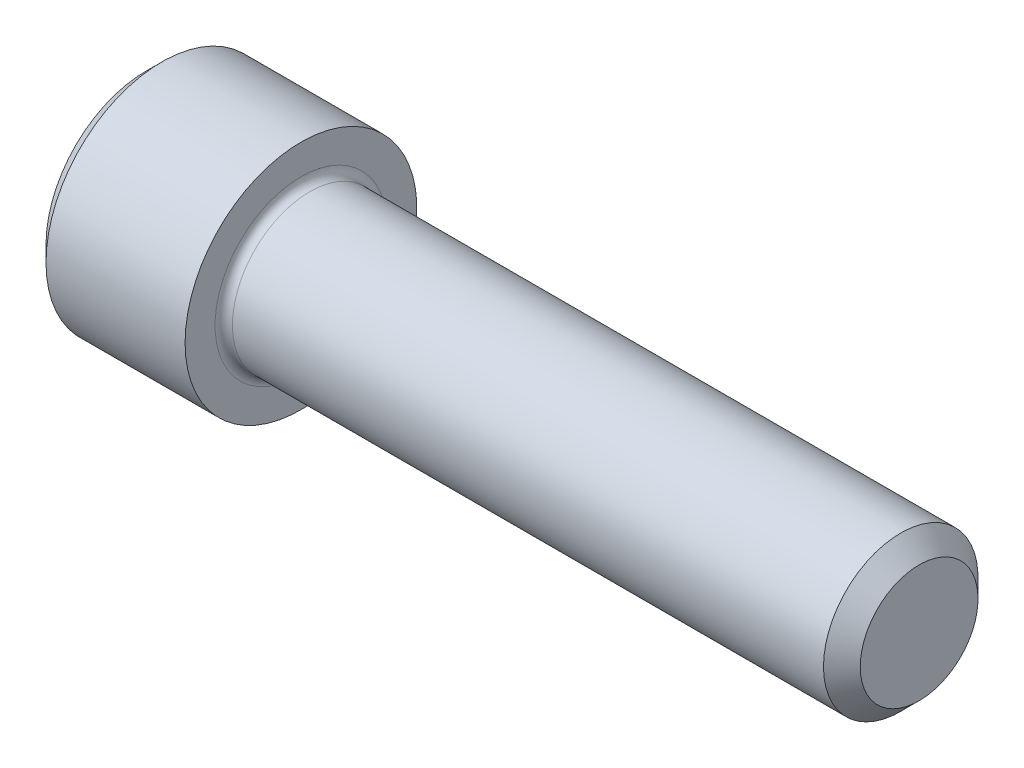
ISO-10303-21;
HEADER;
FILE_DESCRIPTION(('STEP AP214'),'2;1');
FILE_NAME('part.step','',(''),(''),'','','');
FILE_SCHEMA(('AUTOMOTIVE_DESIGN { 1 0 10303 214 1 1 1 1 }'));
ENDSEC;
DATA;
#1=APPLICATION_CONTEXT('core data for automotive mechanical design processes');
#2=APPLICATION_PROTOCOL_DEFINITION('international standard','automotive_design',2000,#1);
#3=PRODUCT_CONTEXT('',#1,'mechanical');
#4=PRODUCT('Part','Part','',(#3));
#5=PRODUCT_RELATED_PRODUCT_CATEGORY('part','',(#4));
#6=PRODUCT_DEFINITION_FORMATION('','',#4);
#7=PRODUCT_DEFINITION_CONTEXT('part definition',#1,'design');
#8=PRODUCT_DEFINITION('design','',#6,#7);
#9=PRODUCT_DEFINITION_SHAPE('','',#8);
#10=(LENGTH_UNIT() NAMED_UNIT(*) SI_UNIT(.MILLI.,.METRE.));
#11=(NAMED_UNIT(*) PLANE_ANGLE_UNIT() SI_UNIT($,.RADIAN.));
#12=(NAMED_UNIT(*) SI_UNIT($,.STERADIAN.) SOLID_ANGLE_UNIT());
#13=UNCERTAINTY_MEASURE_WITH_UNIT(LENGTH_MEASURE(1.E-05),#10,'distance_accuracy_value','');
#14=(GEOMETRIC_REPRESENTATION_CONTEXT(3) GLOBAL_UNCERTAINTY_ASSIGNED_CONTEXT((#13)) GLOBAL_UNIT_ASSIGNED_CONTEXT((#10,
#11,#12)) REPRESENTATION_CONTEXT('',''));
#15=CARTESIAN_POINT('',(0.,0.,0.));
#16=DIRECTION('',(0.,0.,1.));
#17=DIRECTION('',(1.,0.,0.));
#18=AXIS2_PLACEMENT_3D('',#15,#16,#17);
#19=CARTESIAN_POINT('',(0.,0.,0.));
#20=DIRECTION('',(-1.,0.,0.));
#21=DIRECTION('',(0.,0.,1.));
#22=AXIS2_PLACEMENT_3D('',#19,#20,#21);
#23=PLANE('',#22);
#24=DIRECTION('',(0.,-0.499999999999999,0.86602540378444));
#25=VECTOR('',#24,1.);
#26=CARTESIAN_POINT('',(0.,2.7496306570156,0.));
#27=LINE('',#26,#25);
#28=CARTESIAN_POINT('',(0.,2.7496306570156,0.));
#29=VERTEX_POINT('',#28);
#30=CARTESIAN_POINT('',(0.,1.37481532850781,2.38125));
#31=VERTEX_POINT('',#30);
#32=EDGE_CURVE('E257',#29,#31,#27,.T.);
#33=ORIENTED_EDGE('',*,*,#32,.T.);
#34=DIRECTION('',(0.,1.,0.));
#35=VECTOR('',#34,1.);
#36=CARTESIAN_POINT('',(0.,-1.37481532850779,2.38125));
#37=LINE('',#36,#35);
#38=CARTESIAN_POINT('',(0.,-1.37481532850779,2.38125));
#39=VERTEX_POINT('',#38);
#40=EDGE_CURVE('E128',#39,#31,#37,.T.);
#41=ORIENTED_EDGE('',*,*,#40,.F.);
#42=DIRECTION('',(0.,-0.500000000000001,-0.866025403784438));
#43=VECTOR('',#42,1.);
#44=CARTESIAN_POINT('',(0.,-1.37481532850779,2.38125));
#45=LINE('',#44,#43);
#46=CARTESIAN_POINT('',(0.,-2.74963065701559,0.));
#47=VERTEX_POINT('',#46);
#48=EDGE_CURVE('E260',#39,#47,#45,.T.);
#49=ORIENTED_EDGE('',*,*,#48,.T.);
#50=DIRECTION('',(0.,0.499999999999998,-0.86602540378444));
#51=VECTOR('',#50,1.);
#52=CARTESIAN_POINT('',(0.,-2.74963065701559,0.));
#53=LINE('',#52,#51);
#54=CARTESIAN_POINT('',(0.,-1.37481532850779,-2.38125));
#55=VERTEX_POINT('',#54);
#56=EDGE_CURVE('E263',#47,#55,#53,.T.);
#57=ORIENTED_EDGE('',*,*,#56,.T.);
#58=DIRECTION('',(0.,-1.,0.));
#59=VECTOR('',#58,1.);
#60=CARTESIAN_POINT('',(0.,1.3748153285078,-2.38125));
#61=LINE('',#60,#59);
#62=CARTESIAN_POINT('',(0.,1.3748153285078,-2.38125));
#63=VERTEX_POINT('',#62);
#64=EDGE_CURVE('E266',#63,#55,#61,.T.);
#65=ORIENTED_EDGE('',*,*,#64,.F.);
#66=DIRECTION('',(0.,-0.500000000000001,-0.866025403784438));
#67=VECTOR('',#66,1.);
#68=CARTESIAN_POINT('',(0.,2.7496306570156,0.));
#69=LINE('',#68,#67);
#70=EDGE_CURVE('E123',#29,#63,#69,.T.);
#71=ORIENTED_EDGE('',*,*,#70,.F.);
#72=EDGE_LOOP('',(#33,#41,#49,#57,#65,#71));
#73=FACE_BOUND('',#72,.T.);
#74=CARTESIAN_POINT('',(0.,0.,0.));
#75=DIRECTION('',(-1.,0.,0.));
#76=DIRECTION('',(0.,0.,1.));
#77=AXIS2_PLACEMENT_3D('',#74,#75,#76);
#78=CIRCLE('',#77,4.12749999999999);
#79=CARTESIAN_POINT('',(0.,0.,4.12749999999999));
#80=VERTEX_POINT('',#79);
#81=EDGE_CURVE('E152',#80,#80,#78,.T.);
#82=ORIENTED_EDGE('',*,*,#81,.T.);
#83=EDGE_LOOP('',(#82));
#84=FACE_BOUND('',#83,.T.);
#85=ADVANCED_FACE('F32',(#73,#84),#23,.T.);
#86=CARTESIAN_POINT('',(0.,0.,0.));
#87=DIRECTION('',(1.,0.,0.));
#88=DIRECTION('',(0.,0.,-1.));
#89=AXIS2_PLACEMENT_3D('',#86,#87,#88);
#90=CONICAL_SURFACE('',#89,4.12749999999999,0.785398163397457);
#91=CARTESIAN_POINT('',(0.634999999999997,0.,0.));
#92=DIRECTION('',(-1.,0.,0.));
#93=DIRECTION('',(0.,0.,1.));
#94=AXIS2_PLACEMENT_3D('',#91,#92,#93);
#95=CIRCLE('',#94,4.7625);
#96=CARTESIAN_POINT('',(0.634999999999997,0.,4.7625));
#97=VERTEX_POINT('',#96);
#98=EDGE_CURVE('E149',#97,#97,#95,.T.);
#99=ORIENTED_EDGE('',*,*,#98,.T.);
#100=EDGE_LOOP('',(#99));
#101=FACE_BOUND('',#100,.T.);
#102=ORIENTED_EDGE('',*,*,#81,.F.);
#103=EDGE_LOOP('',(#102));
#104=FACE_BOUND('',#103,.T.);
#105=ADVANCED_FACE('F173',(#101,#104),#90,.T.);
#106=CARTESIAN_POINT('',(-31.75,0.,0.));
#107=DIRECTION('',(-1.,0.,0.));
#108=DIRECTION('',(0.,0.,1.));
#109=AXIS2_PLACEMENT_3D('',#106,#107,#108);
#110=CYLINDRICAL_SURFACE('',#109,4.7625);
#111=CARTESIAN_POINT('',(6.35,0.,0.));
#112=DIRECTION('',(-1.,0.,0.));
#113=DIRECTION('',(0.,0.,1.));
#114=AXIS2_PLACEMENT_3D('',#111,#112,#113);
#115=CIRCLE('',#114,4.7625);
#116=CARTESIAN_POINT('',(6.35,0.,4.7625));
#117=VERTEX_POINT('',#116);
#118=EDGE_CURVE('E146',#117,#117,#115,.T.);
#119=ORIENTED_EDGE('',*,*,#118,.T.);
#120=EDGE_LOOP('',(#119));
#121=FACE_BOUND('',#120,.T.);
#122=ORIENTED_EDGE('',*,*,#98,.F.);
#123=EDGE_LOOP('',(#122));
#124=FACE_BOUND('',#123,.T.);
#125=ADVANCED_FACE('F178',(#121,#124),#110,.T.);
#126=CARTESIAN_POINT('',(6.35,4.7625,0.));
#127=DIRECTION('',(1.,0.,0.));
#128=DIRECTION('',(0.,0.,-1.));
#129=AXIS2_PLACEMENT_3D('',#126,#127,#128);
#130=PLANE('',#129);
#131=CARTESIAN_POINT('',(6.35,0.,0.));
#132=DIRECTION('',(1.,0.,0.));
#133=DIRECTION('',(0.,0.,-1.));
#134=AXIS2_PLACEMENT_3D('',#131,#132,#133);
#135=CIRCLE('',#134,3.5306);
#136=CARTESIAN_POINT('',(6.35,0.,-3.5306));
#137=VERTEX_POINT('',#136);
#138=EDGE_CURVE('E40',#137,#137,#135,.F.);
#139=ORIENTED_EDGE('',*,*,#138,.T.);
#140=EDGE_LOOP('',(#139));
#141=FACE_BOUND('',#140,.T.);
#142=ORIENTED_EDGE('',*,*,#118,.F.);
#143=EDGE_LOOP('',(#142));
#144=FACE_BOUND('',#143,.T.);
#145=ADVANCED_FACE('F157',(#141,#144),#130,.T.);
#146=CARTESIAN_POINT('',(-31.75,0.,0.));
#147=DIRECTION('',(-1.,0.,0.));
#148=DIRECTION('',(0.,0.,1.));
#149=AXIS2_PLACEMENT_3D('',#146,#147,#148);
#150=CYLINDRICAL_SURFACE('',#149,3.175);
#151=CARTESIAN_POINT('',(6.7056,0.,0.));
#152=DIRECTION('',(1.,0.,0.));
#153=DIRECTION('',(0.,0.,-1.));
#154=AXIS2_PLACEMENT_3D('',#151,#152,#153);
#155=CIRCLE('',#154,3.175);
#156=CARTESIAN_POINT('',(6.7056,0.,-3.175));
#157=VERTEX_POINT('',#156);
#158=EDGE_CURVE('E11',#157,#157,#155,.T.);
#159=ORIENTED_EDGE('',*,*,#158,.T.);
#160=EDGE_LOOP('',(#159));
#161=FACE_BOUND('',#160,.T.);
#162=CARTESIAN_POINT('',(30.99435,0.,0.));
#163=DIRECTION('',(-1.,0.,0.));
#164=DIRECTION('',(0.,0.,1.));
#165=AXIS2_PLACEMENT_3D('',#162,#163,#164);
#166=CIRCLE('',#165,3.175);
#167=CARTESIAN_POINT('',(30.99435,0.,3.175));
#168=VERTEX_POINT('',#167);
#169=EDGE_CURVE('E143',#168,#168,#166,.T.);
#170=ORIENTED_EDGE('',*,*,#169,.T.);
#171=EDGE_LOOP('',(#170));
#172=FACE_BOUND('',#171,.T.);
#173=ADVANCED_FACE('F188',(#161,#172),#150,.T.);
#174=CARTESIAN_POINT('',(31.75,0.,0.));
#175=DIRECTION('',(-1.,0.,0.));
#176=DIRECTION('',(0.,0.,1.));
#177=AXIS2_PLACEMENT_3D('',#174,#175,#176);
#178=CONICAL_SURFACE('',#177,2.41935,0.78539816339745);
#179=ORIENTED_EDGE('',*,*,#169,.F.);
#180=EDGE_LOOP('',(#179));
#181=FACE_BOUND('',#180,.T.);
#182=CARTESIAN_POINT('',(31.75,0.,0.));
#183=DIRECTION('',(-1.,0.,0.));
#184=DIRECTION('',(0.,0.,1.));
#185=AXIS2_PLACEMENT_3D('',#182,#183,#184);
#186=CIRCLE('',#185,2.41935);
#187=CARTESIAN_POINT('',(31.75,0.,2.41935));
#188=VERTEX_POINT('',#187);
#189=EDGE_CURVE('E139',#188,#188,#186,.T.);
#190=ORIENTED_EDGE('',*,*,#189,.T.);
#191=EDGE_LOOP('',(#190));
#192=FACE_BOUND('',#191,.T.);
#193=ADVANCED_FACE('F168',(#181,#192),#178,.T.);
#194=CARTESIAN_POINT('',(31.75,2.41935,0.));
#195=DIRECTION('',(1.,0.,0.));
#196=DIRECTION('',(0.,0.,-1.));
#197=AXIS2_PLACEMENT_3D('',#194,#195,#196);
#198=PLANE('',#197);
#199=ORIENTED_EDGE('',*,*,#189,.F.);
#200=EDGE_LOOP('',(#199));
#201=FACE_BOUND('',#200,.T.);
#202=ADVANCED_FACE('F161',(#201),#198,.T.);
#203=CARTESIAN_POINT('',(6.7056,0.,0.));
#204=DIRECTION('',(1.,0.,0.));
#205=DIRECTION('',(0.,0.,-1.));
#206=AXIS2_PLACEMENT_3D('',#203,#204,#205);
#207=TOROIDAL_SURFACE('',#206,3.5306,0.3556);
#208=ORIENTED_EDGE('',*,*,#158,.F.);
#209=EDGE_LOOP('',(#208));
#210=FACE_BOUND('',#209,.T.);
#211=ORIENTED_EDGE('',*,*,#138,.F.);
#212=EDGE_LOOP('',(#211));
#213=FACE_BOUND('',#212,.T.);
#214=ADVANCED_FACE('F34',(#210,#213),#207,.F.);
#215=CARTESIAN_POINT('',(3.048,2.7496306570156,0.));
#216=DIRECTION('',(0.,-0.86602540378444,-0.499999999999998));
#217=DIRECTION('',(0.,0.499999999999998,-0.86602540378444));
#218=AXIS2_PLACEMENT_3D('',#215,#216,#217);
#219=PLANE('',#218);
#220=ORIENTED_EDGE('',*,*,#32,.F.);
#221=DIRECTION('',(-1.,0.,0.));
#222=VECTOR('',#221,1.);
#223=CARTESIAN_POINT('',(3.048,2.7496306570156,0.));
#224=LINE('',#223,#222);
#225=CARTESIAN_POINT('',(3.048,2.7496306570156,0.));
#226=VERTEX_POINT('',#225);
#227=EDGE_CURVE('E247',#226,#29,#224,.T.);
#228=ORIENTED_EDGE('',*,*,#227,.F.);
#229=DIRECTION('',(0.,-0.499999999999999,0.86602540378444));
#230=VECTOR('',#229,1.);
#231=CARTESIAN_POINT('',(3.048,2.7496306570156,0.));
#232=LINE('',#231,#230);
#233=CARTESIAN_POINT('',(3.048,2.0622229927617,1.190625));
#234=VERTEX_POINT('',#233);
#235=EDGE_CURVE('E115',#226,#234,#232,.T.);
#236=ORIENTED_EDGE('',*,*,#235,.T.);
#237=CARTESIAN_POINT('',(3.048,1.37481532850781,2.38125));
#238=VERTEX_POINT('',#237);
#239=EDGE_CURVE('E106',#234,#238,#232,.T.);
#240=ORIENTED_EDGE('',*,*,#239,.T.);
#241=DIRECTION('',(-1.,0.,0.));
#242=VECTOR('',#241,1.);
#243=CARTESIAN_POINT('',(3.048,1.37481532850781,2.38125));
#244=LINE('',#243,#242);
#245=EDGE_CURVE('E120',#238,#31,#244,.T.);
#246=ORIENTED_EDGE('',*,*,#245,.T.);
#247=EDGE_LOOP('',(#220,#228,#236,#240,#246));
#248=FACE_BOUND('',#247,.T.);
#249=ADVANCED_FACE('F119',(#248),#219,.T.);
#250=CARTESIAN_POINT('',(3.048,-1.37481532850779,2.38125));
#251=DIRECTION('',(0.,0.,1.));
#252=DIRECTION('',(0.,-1.,0.));
#253=AXIS2_PLACEMENT_3D('',#250,#251,#252);
#254=PLANE('',#253);
#255=ORIENTED_EDGE('',*,*,#40,.T.);
#256=ORIENTED_EDGE('',*,*,#245,.F.);
#257=DIRECTION('',(0.,1.,0.));
#258=VECTOR('',#257,1.);
#259=CARTESIAN_POINT('',(3.048,-1.37481532850779,2.38125));
#260=LINE('',#259,#258);
#261=CARTESIAN_POINT('',(3.048,0.,2.38125));
#262=VERTEX_POINT('',#261);
#263=EDGE_CURVE('E103',#262,#238,#260,.T.);
#264=ORIENTED_EDGE('',*,*,#263,.F.);
#265=CARTESIAN_POINT('',(3.048,-1.37481532850779,2.38125));
#266=VERTEX_POINT('',#265);
#267=EDGE_CURVE('E114',#266,#262,#260,.T.);
#268=ORIENTED_EDGE('',*,*,#267,.F.);
#269=DIRECTION('',(-1.,0.,0.));
#270=VECTOR('',#269,1.);
#271=CARTESIAN_POINT('',(3.048,-1.37481532850779,2.38125));
#272=LINE('',#271,#270);
#273=EDGE_CURVE('E130',#266,#39,#272,.T.);
#274=ORIENTED_EDGE('',*,*,#273,.T.);
#275=EDGE_LOOP('',(#255,#256,#264,#268,#274));
#276=FACE_BOUND('',#275,.T.);
#277=ADVANCED_FACE('F125',(#276),#254,.F.);
#278=CARTESIAN_POINT('',(3.048,-1.37481532850779,2.38125));
#279=DIRECTION('',(0.,0.866025403784438,-0.500000000000001));
#280=DIRECTION('',(0.,0.500000000000001,0.866025403784438));
#281=AXIS2_PLACEMENT_3D('',#278,#279,#280);
#282=PLANE('',#281);
#283=ORIENTED_EDGE('',*,*,#48,.F.);
#284=ORIENTED_EDGE('',*,*,#273,.F.);
#285=DIRECTION('',(0.,-0.500000000000001,-0.866025403784438));
#286=VECTOR('',#285,1.);
#287=CARTESIAN_POINT('',(3.048,-1.37481532850779,2.38125));
#288=LINE('',#287,#286);
#289=CARTESIAN_POINT('',(3.048,-2.06222299276169,1.190625));
#290=VERTEX_POINT('',#289);
#291=EDGE_CURVE('E286',#266,#290,#288,.T.);
#292=ORIENTED_EDGE('',*,*,#291,.T.);
#293=CARTESIAN_POINT('',(3.048,-2.74963065701559,0.));
#294=VERTEX_POINT('',#293);
#295=EDGE_CURVE('E275',#290,#294,#288,.T.);
#296=ORIENTED_EDGE('',*,*,#295,.T.);
#297=DIRECTION('',(-1.,0.,0.));
#298=VECTOR('',#297,1.);
#299=CARTESIAN_POINT('',(3.048,-2.74963065701559,0.));
#300=LINE('',#299,#298);
#301=EDGE_CURVE('E135',#294,#47,#300,.T.);
#302=ORIENTED_EDGE('',*,*,#301,.T.);
#303=EDGE_LOOP('',(#283,#284,#292,#296,#302));
#304=FACE_BOUND('',#303,.T.);
#305=ADVANCED_FACE('F201',(#304),#282,.T.);
#306=CARTESIAN_POINT('',(3.048,-2.74963065701559,0.));
#307=DIRECTION('',(0.,0.86602540378444,0.499999999999998));
#308=DIRECTION('',(0.,-0.499999999999998,0.86602540378444));
#309=AXIS2_PLACEMENT_3D('',#306,#307,#308);
#310=PLANE('',#309);
#311=ORIENTED_EDGE('',*,*,#56,.F.);
#312=ORIENTED_EDGE('',*,*,#301,.F.);
#313=DIRECTION('',(0.,0.499999999999998,-0.86602540378444));
#314=VECTOR('',#313,1.);
#315=CARTESIAN_POINT('',(3.048,-2.74963065701559,0.));
#316=LINE('',#315,#314);
#317=CARTESIAN_POINT('',(3.048,-2.06222299276169,-1.19062499999999));
#318=VERTEX_POINT('',#317);
#319=EDGE_CURVE('E253',#294,#318,#316,.T.);
#320=ORIENTED_EDGE('',*,*,#319,.T.);
#321=CARTESIAN_POINT('',(3.048,-1.37481532850779,-2.38125));
#322=VERTEX_POINT('',#321);
#323=EDGE_CURVE('E285',#318,#322,#316,.T.);
#324=ORIENTED_EDGE('',*,*,#323,.T.);
#325=DIRECTION('',(-1.,0.,0.));
#326=VECTOR('',#325,1.);
#327=CARTESIAN_POINT('',(3.048,-1.37481532850779,-2.38125));
#328=LINE('',#327,#326);
#329=EDGE_CURVE('E246',#322,#55,#328,.T.);
#330=ORIENTED_EDGE('',*,*,#329,.T.);
#331=EDGE_LOOP('',(#311,#312,#320,#324,#330));
#332=FACE_BOUND('',#331,.T.);
#333=ADVANCED_FACE('F204',(#332),#310,.T.);
#334=CARTESIAN_POINT('',(3.048,1.3748153285078,-2.38125));
#335=DIRECTION('',(0.,0.,-1.));
#336=DIRECTION('',(0.,1.,0.));
#337=AXIS2_PLACEMENT_3D('',#334,#335,#336);
#338=PLANE('',#337);
#339=ORIENTED_EDGE('',*,*,#64,.T.);
#340=ORIENTED_EDGE('',*,*,#329,.F.);
#341=DIRECTION('',(0.,-1.,0.));
#342=VECTOR('',#341,1.);
#343=CARTESIAN_POINT('',(3.048,1.3748153285078,-2.38125));
#344=LINE('',#343,#342);
#345=CARTESIAN_POINT('',(3.048,0.,-2.38125));
#346=VERTEX_POINT('',#345);
#347=EDGE_CURVE('E250',#346,#322,#344,.T.);
#348=ORIENTED_EDGE('',*,*,#347,.F.);
#349=CARTESIAN_POINT('',(3.048,1.3748153285078,-2.38125));
#350=VERTEX_POINT('',#349);
#351=EDGE_CURVE('E47',#350,#346,#344,.T.);
#352=ORIENTED_EDGE('',*,*,#351,.F.);
#353=DIRECTION('',(-1.,0.,0.));
#354=VECTOR('',#353,1.);
#355=CARTESIAN_POINT('',(3.048,1.3748153285078,-2.38125));
#356=LINE('',#355,#354);
#357=EDGE_CURVE('E243',#350,#63,#356,.T.);
#358=ORIENTED_EDGE('',*,*,#357,.T.);
#359=EDGE_LOOP('',(#339,#340,#348,#352,#358));
#360=FACE_BOUND('',#359,.T.);
#361=ADVANCED_FACE('F208',(#360),#338,.F.);
#362=CARTESIAN_POINT('',(3.048,2.7496306570156,0.));
#363=DIRECTION('',(0.,0.866025403784438,-0.500000000000001));
#364=DIRECTION('',(0.,0.500000000000001,0.866025403784438));
#365=AXIS2_PLACEMENT_3D('',#362,#363,#364);
#366=PLANE('',#365);
#367=ORIENTED_EDGE('',*,*,#70,.T.);
#368=ORIENTED_EDGE('',*,*,#357,.F.);
#369=DIRECTION('',(0.,-0.500000000000001,-0.866025403784438));
#370=VECTOR('',#369,1.);
#371=CARTESIAN_POINT('',(3.048,2.7496306570156,0.));
#372=LINE('',#371,#370);
#373=CARTESIAN_POINT('',(3.048,2.0622229927617,-1.19062500000001));
#374=VERTEX_POINT('',#373);
#375=EDGE_CURVE('E233',#374,#350,#372,.T.);
#376=ORIENTED_EDGE('',*,*,#375,.F.);
#377=EDGE_CURVE('E239',#226,#374,#372,.T.);
#378=ORIENTED_EDGE('',*,*,#377,.F.);
#379=ORIENTED_EDGE('',*,*,#227,.T.);
#380=EDGE_LOOP('',(#367,#368,#376,#378,#379));
#381=FACE_BOUND('',#380,.T.);
#382=ADVANCED_FACE('F212',(#381),#366,.F.);
#383=CARTESIAN_POINT('',(3.048,4.12444598552339,-2.38125000000001));
#384=DIRECTION('',(1.,0.,0.));
#385=DIRECTION('',(0.,0.,-1.));
#386=AXIS2_PLACEMENT_3D('',#383,#384,#385);
#387=PLANE('',#386);
#388=ORIENTED_EDGE('',*,*,#347,.T.);
#389=ORIENTED_EDGE('',*,*,#323,.F.);
#390=CARTESIAN_POINT('',(3.048,0.,0.));
#391=DIRECTION('',(-1.,0.,0.));
#392=DIRECTION('',(0.,0.,1.));
#393=AXIS2_PLACEMENT_3D('',#390,#391,#392);
#394=CIRCLE('',#393,2.38125);
#395=EDGE_CURVE('E281',#346,#318,#394,.T.);
#396=ORIENTED_EDGE('',*,*,#395,.F.);
#397=EDGE_LOOP('',(#388,#389,#396));
#398=FACE_BOUND('',#397,.T.);
#399=ADVANCED_FACE('F216',(#398),#387,.F.);
#400=ORIENTED_EDGE('',*,*,#319,.F.);
#401=ORIENTED_EDGE('',*,*,#295,.F.);
#402=EDGE_CURVE('E133',#318,#290,#394,.T.);
#403=ORIENTED_EDGE('',*,*,#402,.F.);
#404=EDGE_LOOP('',(#400,#401,#403));
#405=FACE_BOUND('',#404,.T.);
#406=ADVANCED_FACE('F219',(#405),#387,.F.);
#407=ORIENTED_EDGE('',*,*,#291,.F.);
#408=ORIENTED_EDGE('',*,*,#267,.T.);
#409=EDGE_CURVE('E129',#290,#262,#394,.T.);
#410=ORIENTED_EDGE('',*,*,#409,.F.);
#411=EDGE_LOOP('',(#407,#408,#410));
#412=FACE_BOUND('',#411,.T.);
#413=ADVANCED_FACE('F224',(#412),#387,.F.);
#414=ORIENTED_EDGE('',*,*,#263,.T.);
#415=ORIENTED_EDGE('',*,*,#239,.F.);
#416=EDGE_CURVE('E109',#262,#234,#394,.T.);
#417=ORIENTED_EDGE('',*,*,#416,.F.);
#418=EDGE_LOOP('',(#414,#415,#417));
#419=FACE_BOUND('',#418,.T.);
#420=ADVANCED_FACE('F105',(#419),#387,.F.);
#421=ORIENTED_EDGE('',*,*,#235,.F.);
#422=ORIENTED_EDGE('',*,*,#377,.T.);
#423=EDGE_CURVE('E140',#234,#374,#394,.T.);
#424=ORIENTED_EDGE('',*,*,#423,.F.);
#425=EDGE_LOOP('',(#421,#422,#424));
#426=FACE_BOUND('',#425,.T.);
#427=ADVANCED_FACE('F227',(#426),#387,.F.);
#428=ORIENTED_EDGE('',*,*,#375,.T.);
#429=ORIENTED_EDGE('',*,*,#351,.T.);
#430=EDGE_CURVE('E236',#374,#346,#394,.T.);
#431=ORIENTED_EDGE('',*,*,#430,.F.);
#432=EDGE_LOOP('',(#428,#429,#431));
#433=FACE_BOUND('',#432,.T.);
#434=ADVANCED_FACE('F197',(#433),#387,.F.);
#435=CARTESIAN_POINT('',(3.048,0.,0.));
#436=DIRECTION('',(-1.,0.,0.));
#437=DIRECTION('',(0.,0.,1.));
#438=AXIS2_PLACEMENT_3D('',#435,#436,#437);
#439=CONICAL_SURFACE('',#438,2.38125,1.04719755119659);
#440=CARTESIAN_POINT('',(4.42281532850781,0.,0.));
#441=VERTEX_POINT('',#440);
#442=VERTEX_LOOP('',#441);
#443=FACE_BOUND('',#442,.T.);
#444=ORIENTED_EDGE('',*,*,#416,.T.);
#445=ORIENTED_EDGE('',*,*,#423,.T.);
#446=ORIENTED_EDGE('',*,*,#430,.T.);
#447=ORIENTED_EDGE('',*,*,#395,.T.);
#448=ORIENTED_EDGE('',*,*,#402,.T.);
#449=ORIENTED_EDGE('',*,*,#409,.T.);
#450=EDGE_LOOP('',(#444,#445,#446,#447,#448,#449));
#451=FACE_BOUND('',#450,.T.);
#452=ADVANCED_FACE('F195',(#443,#451),#439,.F.);
#453=CLOSED_SHELL('',(#85,#105,#125,#145,#173,#193,#202,#214,#249,#277,#305,#333,#361,#382,#399,
#406,#413,#420,#427,#434,#452));
#454=MANIFOLD_SOLID_BREP('B2',#453);
#455=ADVANCED_BREP_SHAPE_REPRESENTATION('',(#18,#454),#14);
#456=SHAPE_DEFINITION_REPRESENTATION(#9,#455);
ENDSEC;
END-ISO-10303-21;
